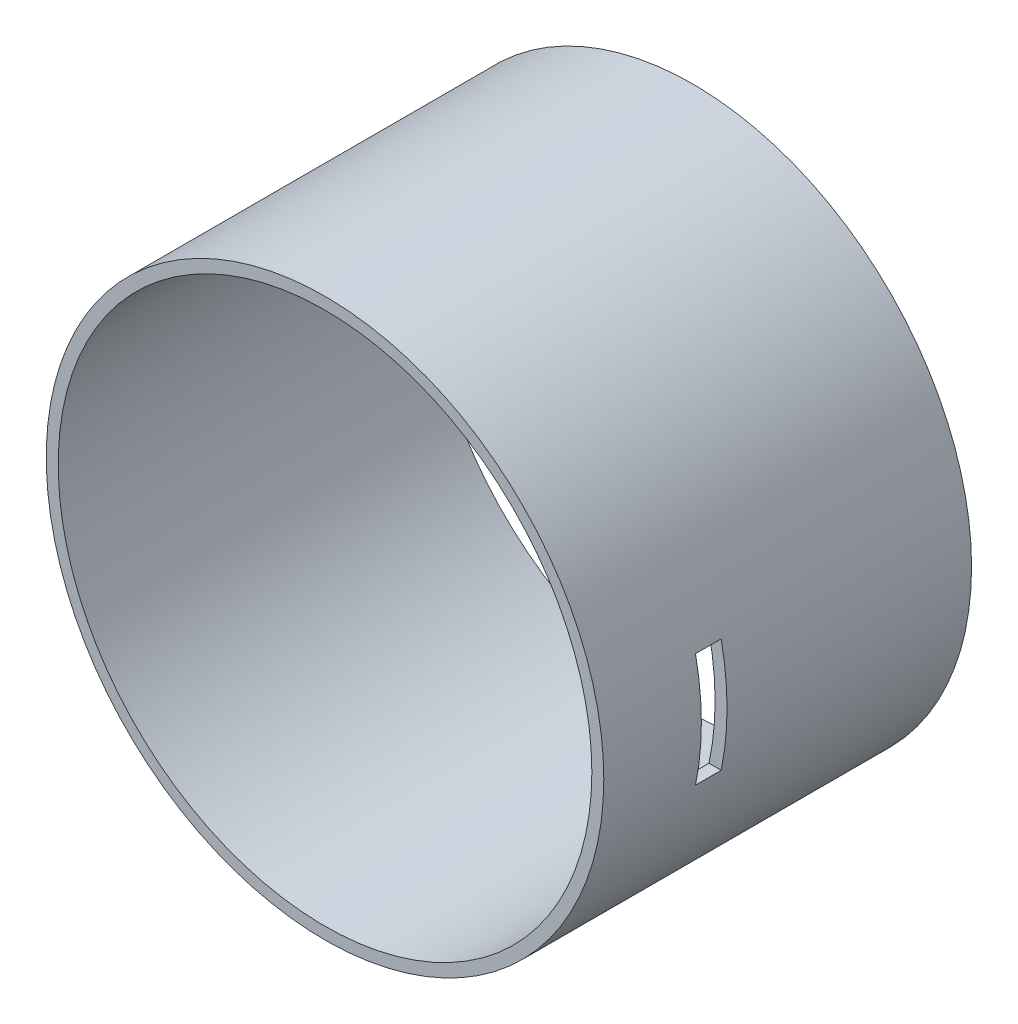
ISO-10303-21;
HEADER;
FILE_DESCRIPTION(('STEP AP214'),'2;1');
FILE_NAME('part.step','',(''),(''),'','','');
FILE_SCHEMA(('AUTOMOTIVE_DESIGN { 1 0 10303 214 1 1 1 1 }'));
ENDSEC;
DATA;
#1=APPLICATION_CONTEXT('core data for automotive mechanical design processes');
#2=APPLICATION_PROTOCOL_DEFINITION('international standard','automotive_design',2000,#1);
#3=PRODUCT_CONTEXT('',#1,'mechanical');
#4=PRODUCT('Part','Part','',(#3));
#5=PRODUCT_RELATED_PRODUCT_CATEGORY('part','',(#4));
#6=PRODUCT_DEFINITION_FORMATION('','',#4);
#7=PRODUCT_DEFINITION_CONTEXT('part definition',#1,'design');
#8=PRODUCT_DEFINITION('design','',#6,#7);
#9=PRODUCT_DEFINITION_SHAPE('','',#8);
#10=(LENGTH_UNIT() NAMED_UNIT(*) SI_UNIT(.MILLI.,.METRE.));
#11=(NAMED_UNIT(*) PLANE_ANGLE_UNIT() SI_UNIT($,.RADIAN.));
#12=(NAMED_UNIT(*) SI_UNIT($,.STERADIAN.) SOLID_ANGLE_UNIT());
#13=UNCERTAINTY_MEASURE_WITH_UNIT(LENGTH_MEASURE(1.E-05),#10,'distance_accuracy_value','');
#14=(GEOMETRIC_REPRESENTATION_CONTEXT(3) GLOBAL_UNCERTAINTY_ASSIGNED_CONTEXT((#13)) GLOBAL_UNIT_ASSIGNED_CONTEXT((#10,
#11,#12)) REPRESENTATION_CONTEXT('',''));
#15=CARTESIAN_POINT('',(0.,0.,0.));
#16=DIRECTION('',(0.,0.,1.));
#17=DIRECTION('',(1.,0.,0.));
#18=AXIS2_PLACEMENT_3D('',#15,#16,#17);
#19=CARTESIAN_POINT('',(0.,0.,184.7));
#20=DIRECTION('',(0.,0.,-1.));
#21=DIRECTION('',(-1.,0.,0.));
#22=AXIS2_PLACEMENT_3D('',#19,#20,#21);
#23=CYLINDRICAL_SURFACE('',#22,140.);
#24=CARTESIAN_POINT('',(0.,0.,184.7));
#25=DIRECTION('',(0.,0.,1.));
#26=DIRECTION('',(1.,0.,0.));
#27=AXIS2_PLACEMENT_3D('',#24,#25,#26);
#28=CIRCLE('',#27,140.);
#29=CARTESIAN_POINT('',(140.,0.,184.7));
#30=VERTEX_POINT('',#29);
#31=EDGE_CURVE('E188',#30,#30,#28,.T.);
#32=ORIENTED_EDGE('',*,*,#31,.F.);
#33=EDGE_LOOP('',(#32));
#34=FACE_BOUND('',#33,.T.);
#35=CARTESIAN_POINT('',(0.,0.,0.));
#36=DIRECTION('',(0.,0.,1.));
#37=DIRECTION('',(1.,0.,0.));
#38=AXIS2_PLACEMENT_3D('',#35,#36,#37);
#39=CIRCLE('',#38,140.);
#40=CARTESIAN_POINT('',(140.,0.,0.));
#41=VERTEX_POINT('',#40);
#42=EDGE_CURVE('E185',#41,#41,#39,.T.);
#43=ORIENTED_EDGE('',*,*,#42,.T.);
#44=EDGE_LOOP('',(#43));
#45=FACE_BOUND('',#44,.T.);
#46=CARTESIAN_POINT('',(0.,0.,122.8));
#47=DIRECTION('',(0.,0.,1.));
#48=DIRECTION('',(1.,0.,0.));
#49=AXIS2_PLACEMENT_3D('',#46,#47,#48);
#50=CIRCLE('',#49,140.);
#51=CARTESIAN_POINT('',(137.052797764219,-28.575,122.8));
#52=VERTEX_POINT('',#51);
#53=CARTESIAN_POINT('',(137.052797764219,28.575,122.8));
#54=VERTEX_POINT('',#53);
#55=EDGE_CURVE('E111',#52,#54,#50,.T.);
#56=ORIENTED_EDGE('',*,*,#55,.F.);
#57=DIRECTION('',(0.,0.,-1.));
#58=VECTOR('',#57,1.);
#59=CARTESIAN_POINT('',(137.052797764219,-28.575,184.7));
#60=LINE('',#59,#58);
#61=CARTESIAN_POINT('',(137.052797764219,-28.575,135.7));
#62=VERTEX_POINT('',#61);
#63=EDGE_CURVE('E112',#62,#52,#60,.T.);
#64=ORIENTED_EDGE('',*,*,#63,.F.);
#65=CARTESIAN_POINT('',(0.,0.,135.7));
#66=DIRECTION('',(0.,0.,-1.));
#67=DIRECTION('',(-1.,0.,0.));
#68=AXIS2_PLACEMENT_3D('',#65,#66,#67);
#69=CIRCLE('',#68,140.);
#70=CARTESIAN_POINT('',(137.052797764219,28.575,135.7));
#71=VERTEX_POINT('',#70);
#72=EDGE_CURVE('E58',#71,#62,#69,.T.);
#73=ORIENTED_EDGE('',*,*,#72,.F.);
#74=DIRECTION('',(0.,0.,-1.));
#75=VECTOR('',#74,1.);
#76=CARTESIAN_POINT('',(137.052797764219,28.575,184.7));
#77=LINE('',#76,#75);
#78=EDGE_CURVE('E113',#54,#71,#77,.F.);
#79=ORIENTED_EDGE('',*,*,#78,.F.);
#80=EDGE_LOOP('',(#56,#64,#73,#79));
#81=FACE_BOUND('',#80,.T.);
#82=ADVANCED_FACE('F44',(#34,#45,#81),#23,.T.);
#83=CARTESIAN_POINT('',(0.,0.,184.7));
#84=DIRECTION('',(0.,0.,-1.));
#85=DIRECTION('',(-1.,0.,0.));
#86=AXIS2_PLACEMENT_3D('',#83,#84,#85);
#87=CYLINDRICAL_SURFACE('',#86,134.);
#88=CARTESIAN_POINT('',(0.,0.,184.7));
#89=DIRECTION('',(0.,0.,1.));
#90=DIRECTION('',(1.,0.,0.));
#91=AXIS2_PLACEMENT_3D('',#88,#89,#90);
#92=CIRCLE('',#91,134.);
#93=CARTESIAN_POINT('',(134.,0.,184.7));
#94=VERTEX_POINT('',#93);
#95=EDGE_CURVE('E182',#94,#94,#92,.T.);
#96=ORIENTED_EDGE('',*,*,#95,.T.);
#97=EDGE_LOOP('',(#96));
#98=FACE_BOUND('',#97,.T.);
#99=CARTESIAN_POINT('',(0.,0.,0.));
#100=DIRECTION('',(0.,0.,1.));
#101=DIRECTION('',(1.,0.,0.));
#102=AXIS2_PLACEMENT_3D('',#99,#100,#101);
#103=CIRCLE('',#102,134.);
#104=CARTESIAN_POINT('',(134.,0.,0.));
#105=VERTEX_POINT('',#104);
#106=EDGE_CURVE('E181',#105,#105,#103,.T.);
#107=ORIENTED_EDGE('',*,*,#106,.F.);
#108=EDGE_LOOP('',(#107));
#109=FACE_BOUND('',#108,.T.);
#110=DIRECTION('',(0.,0.,-1.));
#111=VECTOR('',#110,1.);
#112=CARTESIAN_POINT('',(130.917796250166,-28.575,184.7));
#113=LINE('',#112,#111);
#114=CARTESIAN_POINT('',(130.917796250166,-28.575,135.7));
#115=VERTEX_POINT('',#114);
#116=CARTESIAN_POINT('',(130.917796250166,-28.575,122.8));
#117=VERTEX_POINT('',#116);
#118=EDGE_CURVE('E191',#115,#117,#113,.T.);
#119=ORIENTED_EDGE('',*,*,#118,.T.);
#120=CARTESIAN_POINT('',(0.,0.,122.8));
#121=DIRECTION('',(0.,0.,1.));
#122=DIRECTION('',(1.,0.,0.));
#123=AXIS2_PLACEMENT_3D('',#120,#121,#122);
#124=CIRCLE('',#123,134.);
#125=CARTESIAN_POINT('',(130.917796250166,28.575,122.8));
#126=VERTEX_POINT('',#125);
#127=EDGE_CURVE('E12',#117,#126,#124,.T.);
#128=ORIENTED_EDGE('',*,*,#127,.T.);
#129=DIRECTION('',(0.,0.,-1.));
#130=VECTOR('',#129,1.);
#131=CARTESIAN_POINT('',(130.917796250166,28.575,184.7));
#132=LINE('',#131,#130);
#133=CARTESIAN_POINT('',(130.917796250166,28.575,135.7));
#134=VERTEX_POINT('',#133);
#135=EDGE_CURVE('E51',#126,#134,#132,.F.);
#136=ORIENTED_EDGE('',*,*,#135,.T.);
#137=CARTESIAN_POINT('',(0.,0.,135.7));
#138=DIRECTION('',(0.,0.,-1.));
#139=DIRECTION('',(-1.,0.,0.));
#140=AXIS2_PLACEMENT_3D('',#137,#138,#139);
#141=CIRCLE('',#140,134.);
#142=EDGE_CURVE('E195',#134,#115,#141,.T.);
#143=ORIENTED_EDGE('',*,*,#142,.T.);
#144=EDGE_LOOP('',(#119,#128,#136,#143));
#145=FACE_BOUND('',#144,.T.);
#146=ADVANCED_FACE('F199',(#98,#109,#145),#87,.F.);
#147=CARTESIAN_POINT('',(0.,0.,184.7));
#148=DIRECTION('',(0.,0.,1.));
#149=DIRECTION('',(1.,0.,0.));
#150=AXIS2_PLACEMENT_3D('',#147,#148,#149);
#151=PLANE('',#150);
#152=ORIENTED_EDGE('',*,*,#31,.T.);
#153=EDGE_LOOP('',(#152));
#154=FACE_BOUND('',#153,.T.);
#155=ORIENTED_EDGE('',*,*,#95,.F.);
#156=EDGE_LOOP('',(#155));
#157=FACE_BOUND('',#156,.T.);
#158=ADVANCED_FACE('F216',(#154,#157),#151,.T.);
#159=CARTESIAN_POINT('',(0.,0.,0.));
#160=DIRECTION('',(0.,0.,1.));
#161=DIRECTION('',(1.,0.,0.));
#162=AXIS2_PLACEMENT_3D('',#159,#160,#161);
#163=PLANE('',#162);
#164=CARTESIAN_POINT('',(0.,137.,0.));
#165=DIRECTION('',(0.,0.,-1.));
#166=DIRECTION('',(-1.,0.,0.));
#167=AXIS2_PLACEMENT_3D('',#164,#165,#166);
#168=CIRCLE('',#167,0.79999999999999);
#169=CARTESIAN_POINT('',(-0.79999999999999,137.,0.));
#170=VERTEX_POINT('',#169);
#171=EDGE_CURVE('E117',#170,#170,#168,.T.);
#172=ORIENTED_EDGE('',*,*,#171,.F.);
#173=EDGE_LOOP('',(#172));
#174=FACE_BOUND('',#173,.T.);
#175=CARTESIAN_POINT('',(-137.,0.,0.));
#176=DIRECTION('',(0.,0.,-1.));
#177=DIRECTION('',(-1.,0.,0.));
#178=AXIS2_PLACEMENT_3D('',#175,#176,#177);
#179=CIRCLE('',#178,0.799999999999995);
#180=CARTESIAN_POINT('',(-137.8,0.,0.));
#181=VERTEX_POINT('',#180);
#182=EDGE_CURVE('E139',#181,#181,#179,.T.);
#183=ORIENTED_EDGE('',*,*,#182,.F.);
#184=EDGE_LOOP('',(#183));
#185=FACE_BOUND('',#184,.T.);
#186=CARTESIAN_POINT('',(-93.9553765334525,99.1162057323821,0.));
#187=DIRECTION('',(0.,0.,-1.));
#188=DIRECTION('',(-1.,0.,0.));
#189=AXIS2_PLACEMENT_3D('',#186,#187,#188);
#190=CIRCLE('',#189,0.799999999999995);
#191=CARTESIAN_POINT('',(-94.7553765334525,99.1162057323821,0.));
#192=VERTEX_POINT('',#191);
#193=EDGE_CURVE('E145',#192,#192,#190,.T.);
#194=ORIENTED_EDGE('',*,*,#193,.F.);
#195=EDGE_LOOP('',(#194));
#196=FACE_BOUND('',#195,.T.);
#197=CARTESIAN_POINT('',(-96.874,-96.874,0.));
#198=DIRECTION('',(0.,0.,-1.));
#199=DIRECTION('',(-1.,0.,0.));
#200=AXIS2_PLACEMENT_3D('',#197,#198,#199);
#201=CIRCLE('',#200,0.799999999999995);
#202=CARTESIAN_POINT('',(-97.674,-96.874,0.));
#203=VERTEX_POINT('',#202);
#204=EDGE_CURVE('E151',#203,#203,#201,.T.);
#205=ORIENTED_EDGE('',*,*,#204,.F.);
#206=EDGE_LOOP('',(#205));
#207=FACE_BOUND('',#206,.T.);
#208=CARTESIAN_POINT('',(0.,-137.,0.));
#209=DIRECTION('',(0.,0.,-1.));
#210=DIRECTION('',(-1.,0.,0.));
#211=AXIS2_PLACEMENT_3D('',#208,#209,#210);
#212=CIRCLE('',#211,0.79999999999999);
#213=CARTESIAN_POINT('',(-0.79999999999999,-137.,0.));
#214=VERTEX_POINT('',#213);
#215=EDGE_CURVE('E157',#214,#214,#212,.T.);
#216=ORIENTED_EDGE('',*,*,#215,.F.);
#217=EDGE_LOOP('',(#216));
#218=FACE_BOUND('',#217,.T.);
#219=CARTESIAN_POINT('',(96.874,-96.874,0.));
#220=DIRECTION('',(0.,0.,-1.));
#221=DIRECTION('',(-1.,0.,0.));
#222=AXIS2_PLACEMENT_3D('',#219,#220,#221);
#223=CIRCLE('',#222,0.799999999999995);
#224=CARTESIAN_POINT('',(96.074,-96.874,0.));
#225=VERTEX_POINT('',#224);
#226=EDGE_CURVE('E163',#225,#225,#223,.T.);
#227=ORIENTED_EDGE('',*,*,#226,.F.);
#228=EDGE_LOOP('',(#227));
#229=FACE_BOUND('',#228,.T.);
#230=CARTESIAN_POINT('',(137.,0.,0.));
#231=DIRECTION('',(0.,0.,-1.));
#232=DIRECTION('',(-1.,0.,0.));
#233=AXIS2_PLACEMENT_3D('',#230,#231,#232);
#234=CIRCLE('',#233,0.799999999999995);
#235=CARTESIAN_POINT('',(136.2,0.,0.));
#236=VERTEX_POINT('',#235);
#237=EDGE_CURVE('E169',#236,#236,#234,.T.);
#238=ORIENTED_EDGE('',*,*,#237,.F.);
#239=EDGE_LOOP('',(#238));
#240=FACE_BOUND('',#239,.T.);
#241=CARTESIAN_POINT('',(96.874,96.874,0.));
#242=DIRECTION('',(0.,0.,-1.));
#243=DIRECTION('',(-1.,0.,0.));
#244=AXIS2_PLACEMENT_3D('',#241,#242,#243);
#245=CIRCLE('',#244,0.799999999999995);
#246=CARTESIAN_POINT('',(96.074,96.874,0.));
#247=VERTEX_POINT('',#246);
#248=EDGE_CURVE('E175',#247,#247,#245,.T.);
#249=ORIENTED_EDGE('',*,*,#248,.F.);
#250=EDGE_LOOP('',(#249));
#251=FACE_BOUND('',#250,.T.);
#252=ORIENTED_EDGE('',*,*,#42,.F.);
#253=EDGE_LOOP('',(#252));
#254=FACE_BOUND('',#253,.T.);
#255=ORIENTED_EDGE('',*,*,#106,.T.);
#256=EDGE_LOOP('',(#255));
#257=FACE_BOUND('',#256,.T.);
#258=ADVANCED_FACE('F223',(#174,#185,#196,#207,#218,#229,#240,#251,#254,#257),#163,.F.);
#259=CARTESIAN_POINT('',(96.874,96.874,3.6));
#260=DIRECTION('',(0.,0.,-1.));
#261=DIRECTION('',(-1.,0.,0.));
#262=AXIS2_PLACEMENT_3D('',#259,#260,#261);
#263=CONICAL_SURFACE('',#262,0.799999999999995,1.02974425867665);
#264=CARTESIAN_POINT('',(96.874,96.874,4.08068849522205));
#265=VERTEX_POINT('',#264);
#266=VERTEX_LOOP('',#265);
#267=FACE_BOUND('',#266,.T.);
#268=CARTESIAN_POINT('',(96.874,96.874,3.6));
#269=DIRECTION('',(0.,0.,-1.));
#270=DIRECTION('',(-1.,0.,0.));
#271=AXIS2_PLACEMENT_3D('',#268,#269,#270);
#272=CIRCLE('',#271,0.799999999999995);
#273=CARTESIAN_POINT('',(96.074,96.874,3.6));
#274=VERTEX_POINT('',#273);
#275=EDGE_CURVE('E178',#274,#274,#272,.T.);
#276=ORIENTED_EDGE('',*,*,#275,.T.);
#277=EDGE_LOOP('',(#276));
#278=FACE_BOUND('',#277,.T.);
#279=ADVANCED_FACE('F226',(#267,#278),#263,.F.);
#280=CARTESIAN_POINT('',(96.874,96.874,0.));
#281=DIRECTION('',(0.,0.,-1.));
#282=DIRECTION('',(-1.,0.,0.));
#283=AXIS2_PLACEMENT_3D('',#280,#281,#282);
#284=CYLINDRICAL_SURFACE('',#283,0.799999999999995);
#285=ORIENTED_EDGE('',*,*,#275,.F.);
#286=EDGE_LOOP('',(#285));
#287=FACE_BOUND('',#286,.T.);
#288=ORIENTED_EDGE('',*,*,#248,.T.);
#289=EDGE_LOOP('',(#288));
#290=FACE_BOUND('',#289,.T.);
#291=ADVANCED_FACE('F234',(#287,#290),#284,.F.);
#292=CARTESIAN_POINT('',(137.,0.,3.6));
#293=DIRECTION('',(0.,0.,-1.));
#294=DIRECTION('',(-1.,0.,0.));
#295=AXIS2_PLACEMENT_3D('',#292,#293,#294);
#296=CONICAL_SURFACE('',#295,0.799999999999995,1.02974425867665);
#297=CARTESIAN_POINT('',(137.,0.,4.08068849522205));
#298=VERTEX_POINT('',#297);
#299=VERTEX_LOOP('',#298);
#300=FACE_BOUND('',#299,.T.);
#301=CARTESIAN_POINT('',(137.,0.,3.6));
#302=DIRECTION('',(0.,0.,-1.));
#303=DIRECTION('',(-1.,0.,0.));
#304=AXIS2_PLACEMENT_3D('',#301,#302,#303);
#305=CIRCLE('',#304,0.799999999999995);
#306=CARTESIAN_POINT('',(136.2,0.,3.6));
#307=VERTEX_POINT('',#306);
#308=EDGE_CURVE('E172',#307,#307,#305,.T.);
#309=ORIENTED_EDGE('',*,*,#308,.T.);
#310=EDGE_LOOP('',(#309));
#311=FACE_BOUND('',#310,.T.);
#312=ADVANCED_FACE('F244',(#300,#311),#296,.F.);
#313=CARTESIAN_POINT('',(137.,0.,0.));
#314=DIRECTION('',(0.,0.,-1.));
#315=DIRECTION('',(-1.,0.,0.));
#316=AXIS2_PLACEMENT_3D('',#313,#314,#315);
#317=CYLINDRICAL_SURFACE('',#316,0.799999999999995);
#318=ORIENTED_EDGE('',*,*,#308,.F.);
#319=EDGE_LOOP('',(#318));
#320=FACE_BOUND('',#319,.T.);
#321=ORIENTED_EDGE('',*,*,#237,.T.);
#322=EDGE_LOOP('',(#321));
#323=FACE_BOUND('',#322,.T.);
#324=ADVANCED_FACE('F248',(#320,#323),#317,.F.);
#325=CARTESIAN_POINT('',(96.874,-96.874,3.6));
#326=DIRECTION('',(0.,0.,-1.));
#327=DIRECTION('',(-1.,0.,0.));
#328=AXIS2_PLACEMENT_3D('',#325,#326,#327);
#329=CONICAL_SURFACE('',#328,0.799999999999995,1.02974425867665);
#330=CARTESIAN_POINT('',(96.874,-96.874,4.08068849522205));
#331=VERTEX_POINT('',#330);
#332=VERTEX_LOOP('',#331);
#333=FACE_BOUND('',#332,.T.);
#334=CARTESIAN_POINT('',(96.874,-96.874,3.6));
#335=DIRECTION('',(0.,0.,-1.));
#336=DIRECTION('',(-1.,0.,0.));
#337=AXIS2_PLACEMENT_3D('',#334,#335,#336);
#338=CIRCLE('',#337,0.799999999999995);
#339=CARTESIAN_POINT('',(96.074,-96.874,3.6));
#340=VERTEX_POINT('',#339);
#341=EDGE_CURVE('E166',#340,#340,#338,.T.);
#342=ORIENTED_EDGE('',*,*,#341,.T.);
#343=EDGE_LOOP('',(#342));
#344=FACE_BOUND('',#343,.T.);
#345=ADVANCED_FACE('F252',(#333,#344),#329,.F.);
#346=CARTESIAN_POINT('',(96.874,-96.874,0.));
#347=DIRECTION('',(0.,0.,-1.));
#348=DIRECTION('',(-1.,0.,0.));
#349=AXIS2_PLACEMENT_3D('',#346,#347,#348);
#350=CYLINDRICAL_SURFACE('',#349,0.799999999999995);
#351=ORIENTED_EDGE('',*,*,#341,.F.);
#352=EDGE_LOOP('',(#351));
#353=FACE_BOUND('',#352,.T.);
#354=ORIENTED_EDGE('',*,*,#226,.T.);
#355=EDGE_LOOP('',(#354));
#356=FACE_BOUND('',#355,.T.);
#357=ADVANCED_FACE('F256',(#353,#356),#350,.F.);
#358=CARTESIAN_POINT('',(0.,-137.,3.6));
#359=DIRECTION('',(0.,0.,-1.));
#360=DIRECTION('',(-1.,0.,0.));
#361=AXIS2_PLACEMENT_3D('',#358,#359,#360);
#362=CONICAL_SURFACE('',#361,0.799999999999998,1.02974425867665);
#363=CARTESIAN_POINT('',(0.,-137.,4.08068849522205));
#364=VERTEX_POINT('',#363);
#365=VERTEX_LOOP('',#364);
#366=FACE_BOUND('',#365,.T.);
#367=CARTESIAN_POINT('',(0.,-137.,3.6));
#368=DIRECTION('',(0.,0.,-1.));
#369=DIRECTION('',(-1.,0.,0.));
#370=AXIS2_PLACEMENT_3D('',#367,#368,#369);
#371=CIRCLE('',#370,0.799999999999998);
#372=CARTESIAN_POINT('',(-0.799999999999998,-137.,3.6));
#373=VERTEX_POINT('',#372);
#374=EDGE_CURVE('E160',#373,#373,#371,.T.);
#375=ORIENTED_EDGE('',*,*,#374,.T.);
#376=EDGE_LOOP('',(#375));
#377=FACE_BOUND('',#376,.T.);
#378=ADVANCED_FACE('F260',(#366,#377),#362,.F.);
#379=CARTESIAN_POINT('',(0.,-137.,0.));
#380=DIRECTION('',(0.,0.,-1.));
#381=DIRECTION('',(-1.,0.,0.));
#382=AXIS2_PLACEMENT_3D('',#379,#380,#381);
#383=CYLINDRICAL_SURFACE('',#382,0.799999999999994);
#384=ORIENTED_EDGE('',*,*,#374,.F.);
#385=EDGE_LOOP('',(#384));
#386=FACE_BOUND('',#385,.T.);
#387=ORIENTED_EDGE('',*,*,#215,.T.);
#388=EDGE_LOOP('',(#387));
#389=FACE_BOUND('',#388,.T.);
#390=ADVANCED_FACE('F264',(#386,#389),#383,.F.);
#391=CARTESIAN_POINT('',(-96.874,-96.874,3.6));
#392=DIRECTION('',(0.,0.,-1.));
#393=DIRECTION('',(-1.,0.,0.));
#394=AXIS2_PLACEMENT_3D('',#391,#392,#393);
#395=CONICAL_SURFACE('',#394,0.799999999999995,1.02974425867665);
#396=CARTESIAN_POINT('',(-96.874,-96.874,4.08068849522205));
#397=VERTEX_POINT('',#396);
#398=VERTEX_LOOP('',#397);
#399=FACE_BOUND('',#398,.T.);
#400=CARTESIAN_POINT('',(-96.874,-96.874,3.6));
#401=DIRECTION('',(0.,0.,-1.));
#402=DIRECTION('',(-1.,0.,0.));
#403=AXIS2_PLACEMENT_3D('',#400,#401,#402);
#404=CIRCLE('',#403,0.799999999999995);
#405=CARTESIAN_POINT('',(-97.674,-96.874,3.6));
#406=VERTEX_POINT('',#405);
#407=EDGE_CURVE('E154',#406,#406,#404,.T.);
#408=ORIENTED_EDGE('',*,*,#407,.T.);
#409=EDGE_LOOP('',(#408));
#410=FACE_BOUND('',#409,.T.);
#411=ADVANCED_FACE('F268',(#399,#410),#395,.F.);
#412=CARTESIAN_POINT('',(-96.874,-96.874,0.));
#413=DIRECTION('',(0.,0.,-1.));
#414=DIRECTION('',(-1.,0.,0.));
#415=AXIS2_PLACEMENT_3D('',#412,#413,#414);
#416=CYLINDRICAL_SURFACE('',#415,0.799999999999995);
#417=ORIENTED_EDGE('',*,*,#407,.F.);
#418=EDGE_LOOP('',(#417));
#419=FACE_BOUND('',#418,.T.);
#420=ORIENTED_EDGE('',*,*,#204,.T.);
#421=EDGE_LOOP('',(#420));
#422=FACE_BOUND('',#421,.T.);
#423=ADVANCED_FACE('F272',(#419,#422),#416,.F.);
#424=CARTESIAN_POINT('',(-93.9553765334525,99.1162057323821,3.6));
#425=DIRECTION('',(0.,0.,-1.));
#426=DIRECTION('',(-1.,0.,0.));
#427=AXIS2_PLACEMENT_3D('',#424,#425,#426);
#428=CONICAL_SURFACE('',#427,0.799999999999995,1.02974425867665);
#429=CARTESIAN_POINT('',(-93.9553765334525,99.1162057323821,4.08068849522205));
#430=VERTEX_POINT('',#429);
#431=VERTEX_LOOP('',#430);
#432=FACE_BOUND('',#431,.T.);
#433=CARTESIAN_POINT('',(-93.9553765334525,99.1162057323821,3.6));
#434=DIRECTION('',(0.,0.,-1.));
#435=DIRECTION('',(-1.,0.,0.));
#436=AXIS2_PLACEMENT_3D('',#433,#434,#435);
#437=CIRCLE('',#436,0.799999999999995);
#438=CARTESIAN_POINT('',(-94.7553765334525,99.1162057323821,3.6));
#439=VERTEX_POINT('',#438);
#440=EDGE_CURVE('E148',#439,#439,#437,.T.);
#441=ORIENTED_EDGE('',*,*,#440,.T.);
#442=EDGE_LOOP('',(#441));
#443=FACE_BOUND('',#442,.T.);
#444=ADVANCED_FACE('F276',(#432,#443),#428,.F.);
#445=CARTESIAN_POINT('',(-93.9553765334525,99.1162057323821,0.));
#446=DIRECTION('',(0.,0.,-1.));
#447=DIRECTION('',(-1.,0.,0.));
#448=AXIS2_PLACEMENT_3D('',#445,#446,#447);
#449=CYLINDRICAL_SURFACE('',#448,0.799999999999995);
#450=ORIENTED_EDGE('',*,*,#440,.F.);
#451=EDGE_LOOP('',(#450));
#452=FACE_BOUND('',#451,.T.);
#453=ORIENTED_EDGE('',*,*,#193,.T.);
#454=EDGE_LOOP('',(#453));
#455=FACE_BOUND('',#454,.T.);
#456=ADVANCED_FACE('F280',(#452,#455),#449,.F.);
#457=CARTESIAN_POINT('',(-137.,0.,3.6));
#458=DIRECTION('',(0.,0.,-1.));
#459=DIRECTION('',(-1.,0.,0.));
#460=AXIS2_PLACEMENT_3D('',#457,#458,#459);
#461=CONICAL_SURFACE('',#460,0.799999999999995,1.02974425867665);
#462=CARTESIAN_POINT('',(-137.,0.,4.08068849522205));
#463=VERTEX_POINT('',#462);
#464=VERTEX_LOOP('',#463);
#465=FACE_BOUND('',#464,.T.);
#466=CARTESIAN_POINT('',(-137.,0.,3.6));
#467=DIRECTION('',(0.,0.,-1.));
#468=DIRECTION('',(-1.,0.,0.));
#469=AXIS2_PLACEMENT_3D('',#466,#467,#468);
#470=CIRCLE('',#469,0.799999999999995);
#471=CARTESIAN_POINT('',(-137.8,0.,3.6));
#472=VERTEX_POINT('',#471);
#473=EDGE_CURVE('E142',#472,#472,#470,.T.);
#474=ORIENTED_EDGE('',*,*,#473,.T.);
#475=EDGE_LOOP('',(#474));
#476=FACE_BOUND('',#475,.T.);
#477=ADVANCED_FACE('F284',(#465,#476),#461,.F.);
#478=CARTESIAN_POINT('',(-137.,0.,0.));
#479=DIRECTION('',(0.,0.,-1.));
#480=DIRECTION('',(-1.,0.,0.));
#481=AXIS2_PLACEMENT_3D('',#478,#479,#480);
#482=CYLINDRICAL_SURFACE('',#481,0.799999999999995);
#483=ORIENTED_EDGE('',*,*,#473,.F.);
#484=EDGE_LOOP('',(#483));
#485=FACE_BOUND('',#484,.T.);
#486=ORIENTED_EDGE('',*,*,#182,.T.);
#487=EDGE_LOOP('',(#486));
#488=FACE_BOUND('',#487,.T.);
#489=ADVANCED_FACE('F288',(#485,#488),#482,.F.);
#490=CARTESIAN_POINT('',(0.,137.,3.6));
#491=DIRECTION('',(0.,0.,-1.));
#492=DIRECTION('',(-1.,0.,0.));
#493=AXIS2_PLACEMENT_3D('',#490,#491,#492);
#494=CONICAL_SURFACE('',#493,0.799999999999998,1.02974425867665);
#495=CARTESIAN_POINT('',(0.,137.,4.08068849522205));
#496=VERTEX_POINT('',#495);
#497=VERTEX_LOOP('',#496);
#498=FACE_BOUND('',#497,.T.);
#499=CARTESIAN_POINT('',(0.,137.,3.6));
#500=DIRECTION('',(0.,0.,-1.));
#501=DIRECTION('',(-1.,0.,0.));
#502=AXIS2_PLACEMENT_3D('',#499,#500,#501);
#503=CIRCLE('',#502,0.799999999999998);
#504=CARTESIAN_POINT('',(-0.799999999999998,137.,3.6));
#505=VERTEX_POINT('',#504);
#506=EDGE_CURVE('E136',#505,#505,#503,.T.);
#507=ORIENTED_EDGE('',*,*,#506,.T.);
#508=EDGE_LOOP('',(#507));
#509=FACE_BOUND('',#508,.T.);
#510=ADVANCED_FACE('F292',(#498,#509),#494,.F.);
#511=CARTESIAN_POINT('',(0.,137.,0.));
#512=DIRECTION('',(0.,0.,-1.));
#513=DIRECTION('',(-1.,0.,0.));
#514=AXIS2_PLACEMENT_3D('',#511,#512,#513);
#515=CYLINDRICAL_SURFACE('',#514,0.799999999999994);
#516=ORIENTED_EDGE('',*,*,#506,.F.);
#517=EDGE_LOOP('',(#516));
#518=FACE_BOUND('',#517,.T.);
#519=ORIENTED_EDGE('',*,*,#171,.T.);
#520=EDGE_LOOP('',(#519));
#521=FACE_BOUND('',#520,.T.);
#522=ADVANCED_FACE('F296',(#518,#521),#515,.F.);
#523=CARTESIAN_POINT('',(140.,28.575,122.8));
#524=DIRECTION('',(0.,0.,1.));
#525=DIRECTION('',(1.,0.,0.));
#526=AXIS2_PLACEMENT_3D('',#523,#524,#525);
#527=PLANE('',#526);
#528=ORIENTED_EDGE('',*,*,#55,.T.);
#529=DIRECTION('',(-1.,0.,0.));
#530=VECTOR('',#529,1.);
#531=CARTESIAN_POINT('',(140.,28.575,122.8));
#532=LINE('',#531,#530);
#533=EDGE_CURVE('E121',#54,#126,#532,.T.);
#534=ORIENTED_EDGE('',*,*,#533,.T.);
#535=ORIENTED_EDGE('',*,*,#127,.F.);
#536=DIRECTION('',(-1.,0.,0.));
#537=VECTOR('',#536,1.);
#538=CARTESIAN_POINT('',(140.,-28.575,122.8));
#539=LINE('',#538,#537);
#540=EDGE_CURVE('E66',#52,#117,#539,.T.);
#541=ORIENTED_EDGE('',*,*,#540,.F.);
#542=EDGE_LOOP('',(#528,#534,#535,#541));
#543=FACE_BOUND('',#542,.T.);
#544=ADVANCED_FACE('F123',(#543),#527,.T.);
#545=CARTESIAN_POINT('',(140.,28.575,122.8));
#546=DIRECTION('',(0.,-1.,0.));
#547=DIRECTION('',(0.,0.,-1.));
#548=AXIS2_PLACEMENT_3D('',#545,#546,#547);
#549=PLANE('',#548);
#550=ORIENTED_EDGE('',*,*,#78,.T.);
#551=DIRECTION('',(-1.,0.,0.));
#552=VECTOR('',#551,1.);
#553=CARTESIAN_POINT('',(140.,28.575,135.7));
#554=LINE('',#553,#552);
#555=EDGE_CURVE('E126',#71,#134,#554,.T.);
#556=ORIENTED_EDGE('',*,*,#555,.T.);
#557=ORIENTED_EDGE('',*,*,#135,.F.);
#558=ORIENTED_EDGE('',*,*,#533,.F.);
#559=EDGE_LOOP('',(#550,#556,#557,#558));
#560=FACE_BOUND('',#559,.T.);
#561=ADVANCED_FACE('F201',(#560),#549,.T.);
#562=CARTESIAN_POINT('',(140.,28.575,135.7));
#563=DIRECTION('',(0.,0.,-1.));
#564=DIRECTION('',(-1.,0.,0.));
#565=AXIS2_PLACEMENT_3D('',#562,#563,#564);
#566=PLANE('',#565);
#567=ORIENTED_EDGE('',*,*,#72,.T.);
#568=DIRECTION('',(-1.,0.,0.));
#569=VECTOR('',#568,1.);
#570=CARTESIAN_POINT('',(140.,-28.575,135.7));
#571=LINE('',#570,#569);
#572=EDGE_CURVE('E120',#62,#115,#571,.T.);
#573=ORIENTED_EDGE('',*,*,#572,.T.);
#574=ORIENTED_EDGE('',*,*,#142,.F.);
#575=ORIENTED_EDGE('',*,*,#555,.F.);
#576=EDGE_LOOP('',(#567,#573,#574,#575));
#577=FACE_BOUND('',#576,.T.);
#578=ADVANCED_FACE('F202',(#577),#566,.T.);
#579=CARTESIAN_POINT('',(140.,-28.575,122.8));
#580=DIRECTION('',(0.,1.,0.));
#581=DIRECTION('',(0.,0.,1.));
#582=AXIS2_PLACEMENT_3D('',#579,#580,#581);
#583=PLANE('',#582);
#584=ORIENTED_EDGE('',*,*,#63,.T.);
#585=ORIENTED_EDGE('',*,*,#540,.T.);
#586=ORIENTED_EDGE('',*,*,#118,.F.);
#587=ORIENTED_EDGE('',*,*,#572,.F.);
#588=EDGE_LOOP('',(#584,#585,#586,#587));
#589=FACE_BOUND('',#588,.T.);
#590=ADVANCED_FACE('F119',(#589),#583,.T.);
#591=CLOSED_SHELL('',(#82,#146,#158,#258,#279,#291,#312,#324,#345,#357,#378,#390,#411,#423,#444,
#456,#477,#489,#510,#522,#544,#561,#578,#590));
#592=MANIFOLD_SOLID_BREP('B2',#591);
#593=ADVANCED_BREP_SHAPE_REPRESENTATION('',(#18,#592),#14);
#594=SHAPE_DEFINITION_REPRESENTATION(#9,#593);
ENDSEC;
END-ISO-10303-21;
